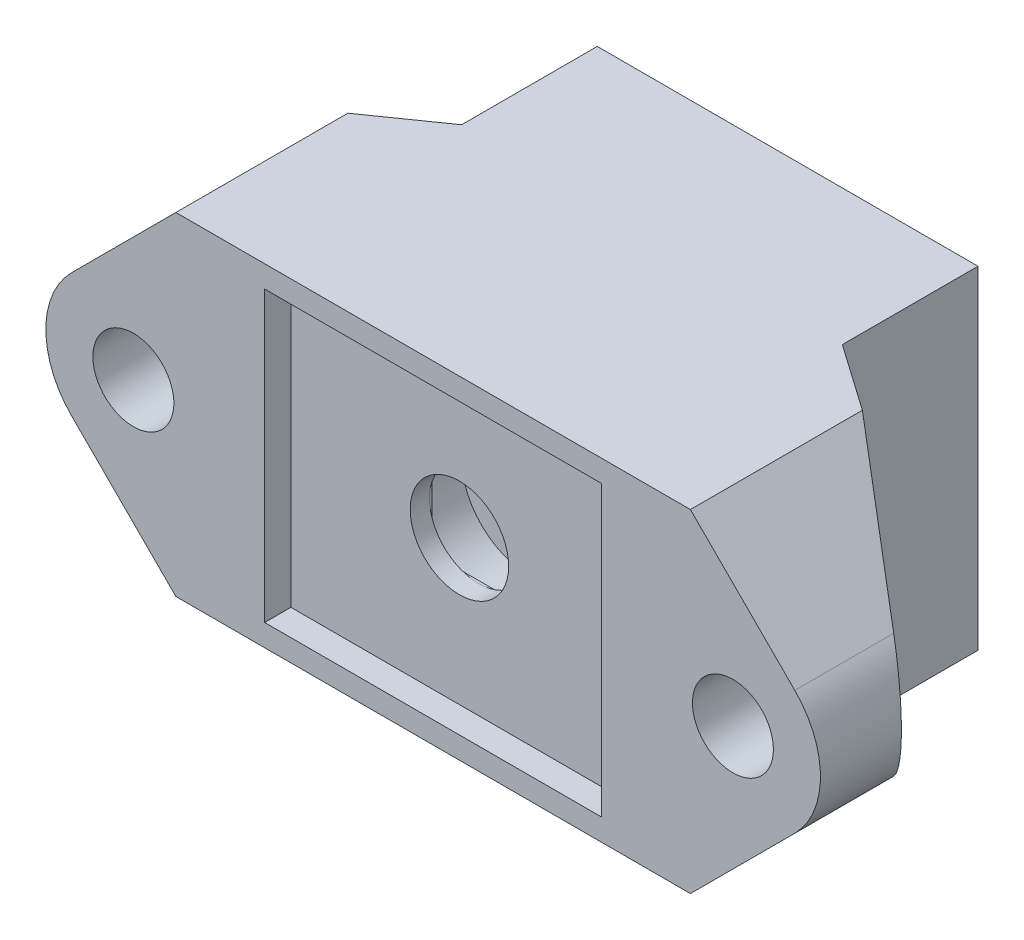
ISO-10303-21;
HEADER;
FILE_DESCRIPTION(('STEP AP214'),'2;1');
FILE_NAME('part.step','',(''),(''),'','','');
FILE_SCHEMA(('AUTOMOTIVE_DESIGN { 1 0 10303 214 1 1 1 1 }'));
ENDSEC;
DATA;
#1=APPLICATION_CONTEXT('core data for automotive mechanical design processes');
#2=APPLICATION_PROTOCOL_DEFINITION('international standard','automotive_design',2000,#1);
#3=PRODUCT_CONTEXT('',#1,'mechanical');
#4=PRODUCT('Part','Part','',(#3));
#5=PRODUCT_RELATED_PRODUCT_CATEGORY('part','',(#4));
#6=PRODUCT_DEFINITION_FORMATION('','',#4);
#7=PRODUCT_DEFINITION_CONTEXT('part definition',#1,'design');
#8=PRODUCT_DEFINITION('design','',#6,#7);
#9=PRODUCT_DEFINITION_SHAPE('','',#8);
#10=(LENGTH_UNIT() NAMED_UNIT(*) SI_UNIT(.MILLI.,.METRE.));
#11=(NAMED_UNIT(*) PLANE_ANGLE_UNIT() SI_UNIT($,.RADIAN.));
#12=(NAMED_UNIT(*) SI_UNIT($,.STERADIAN.) SOLID_ANGLE_UNIT());
#13=UNCERTAINTY_MEASURE_WITH_UNIT(LENGTH_MEASURE(1.E-05),#10,'distance_accuracy_value','');
#14=(GEOMETRIC_REPRESENTATION_CONTEXT(3) GLOBAL_UNCERTAINTY_ASSIGNED_CONTEXT((#13)) GLOBAL_UNIT_ASSIGNED_CONTEXT((#10,
#11,#12)) REPRESENTATION_CONTEXT('',''));
#15=CARTESIAN_POINT('',(0.,0.,0.));
#16=DIRECTION('',(0.,0.,1.));
#17=DIRECTION('',(1.,0.,0.));
#18=AXIS2_PLACEMENT_3D('',#15,#16,#17);
#19=CARTESIAN_POINT('',(0.,0.,0.));
#20=DIRECTION('',(0.,0.,-1.));
#21=DIRECTION('',(-1.,0.,0.));
#22=AXIS2_PLACEMENT_3D('',#19,#20,#21);
#23=PLANE('',#22);
#24=CARTESIAN_POINT('',(0.,0.,0.));
#25=DIRECTION('',(0.,0.,-1.));
#26=DIRECTION('',(-1.,0.,0.));
#27=AXIS2_PLACEMENT_3D('',#24,#25,#26);
#28=CIRCLE('',#27,1.80512886940355);
#29=CARTESIAN_POINT('',(-1.80512886940355,0.,0.));
#30=VERTEX_POINT('',#29);
#31=EDGE_CURVE('E50',#30,#30,#28,.T.);
#32=ORIENTED_EDGE('',*,*,#31,.T.);
#33=EDGE_LOOP('',(#32));
#34=FACE_BOUND('',#33,.T.);
#35=CARTESIAN_POINT('',(0.,0.,0.));
#36=DIRECTION('',(0.,0.,1.));
#37=DIRECTION('',(1.,0.,0.));
#38=AXIS2_PLACEMENT_3D('',#35,#36,#37);
#39=CIRCLE('',#38,1.65);
#40=CARTESIAN_POINT('',(1.65,0.,0.));
#41=VERTEX_POINT('',#40);
#42=EDGE_CURVE('E242',#41,#41,#39,.T.);
#43=ORIENTED_EDGE('',*,*,#42,.T.);
#44=EDGE_LOOP('',(#43));
#45=FACE_BOUND('',#44,.T.);
#46=ADVANCED_FACE('F41',(#34,#45),#23,.T.);
#47=CARTESIAN_POINT('',(0.,0.,4.));
#48=DIRECTION('',(0.,0.,1.));
#49=DIRECTION('',(1.,0.,0.));
#50=AXIS2_PLACEMENT_3D('',#47,#48,#49);
#51=PLANE('',#50);
#52=CARTESIAN_POINT('',(0.,0.,4.));
#53=DIRECTION('',(0.,0.,1.));
#54=DIRECTION('',(1.,0.,0.));
#55=AXIS2_PLACEMENT_3D('',#52,#53,#54);
#56=CIRCLE('',#55,3.1);
#57=CARTESIAN_POINT('',(-2.25,2.13248681121361,4.));
#58=VERTEX_POINT('',#57);
#59=CARTESIAN_POINT('',(-2.25,-2.13248681121361,4.));
#60=VERTEX_POINT('',#59);
#61=EDGE_CURVE('E494',#58,#60,#56,.T.);
#62=ORIENTED_EDGE('',*,*,#61,.F.);
#63=DIRECTION('',(0.,1.,0.));
#64=VECTOR('',#63,1.);
#65=CARTESIAN_POINT('',(-2.25,-2.25,4.));
#66=LINE('',#65,#64);
#67=EDGE_CURVE('E377',#60,#58,#66,.T.);
#68=ORIENTED_EDGE('',*,*,#67,.F.);
#69=EDGE_LOOP('',(#62,#68));
#70=FACE_BOUND('',#69,.T.);
#71=ADVANCED_FACE('F286',(#70),#51,.F.);
#72=CARTESIAN_POINT('',(-2.13248681121361,-2.25,4.));
#73=VERTEX_POINT('',#72);
#74=CARTESIAN_POINT('',(2.13248681121361,-2.25,4.));
#75=VERTEX_POINT('',#74);
#76=EDGE_CURVE('E496',#73,#75,#56,.T.);
#77=ORIENTED_EDGE('',*,*,#76,.F.);
#78=DIRECTION('',(-1.,0.,0.));
#79=VECTOR('',#78,1.);
#80=CARTESIAN_POINT('',(2.25,-2.25,4.));
#81=LINE('',#80,#79);
#82=EDGE_CURVE('E390',#75,#73,#81,.T.);
#83=ORIENTED_EDGE('',*,*,#82,.F.);
#84=EDGE_LOOP('',(#77,#83));
#85=FACE_BOUND('',#84,.T.);
#86=ADVANCED_FACE('F291',(#85),#51,.F.);
#87=CARTESIAN_POINT('',(2.25,-2.13248681121361,4.));
#88=VERTEX_POINT('',#87);
#89=CARTESIAN_POINT('',(2.25,2.13248681121361,4.));
#90=VERTEX_POINT('',#89);
#91=EDGE_CURVE('E409',#88,#90,#56,.T.);
#92=ORIENTED_EDGE('',*,*,#91,.F.);
#93=DIRECTION('',(0.,-1.,0.));
#94=VECTOR('',#93,1.);
#95=CARTESIAN_POINT('',(2.25,-2.25,4.));
#96=LINE('',#95,#94);
#97=EDGE_CURVE('E386',#90,#88,#96,.T.);
#98=ORIENTED_EDGE('',*,*,#97,.F.);
#99=EDGE_LOOP('',(#92,#98));
#100=FACE_BOUND('',#99,.T.);
#101=ADVANCED_FACE('F456',(#100),#51,.F.);
#102=CARTESIAN_POINT('',(0.,0.,5.));
#103=DIRECTION('',(0.,0.,-1.));
#104=DIRECTION('',(-1.,0.,0.));
#105=AXIS2_PLACEMENT_3D('',#102,#103,#104);
#106=CYLINDRICAL_SURFACE('',#105,1.65);
#107=ORIENTED_EDGE('',*,*,#42,.F.);
#108=EDGE_LOOP('',(#107));
#109=FACE_BOUND('',#108,.T.);
#110=CARTESIAN_POINT('',(0.,0.,1.8));
#111=DIRECTION('',(0.,0.,1.));
#112=DIRECTION('',(1.,0.,0.));
#113=AXIS2_PLACEMENT_3D('',#110,#111,#112);
#114=CIRCLE('',#113,1.65);
#115=CARTESIAN_POINT('',(1.65,0.,1.8));
#116=VERTEX_POINT('',#115);
#117=EDGE_CURVE('E248',#116,#116,#114,.T.);
#118=ORIENTED_EDGE('',*,*,#117,.T.);
#119=EDGE_LOOP('',(#118));
#120=FACE_BOUND('',#119,.T.);
#121=ADVANCED_FACE('F453',(#109,#120),#106,.F.);
#122=CARTESIAN_POINT('',(0.,0.,5.));
#123=DIRECTION('',(0.,0.,-1.));
#124=DIRECTION('',(-1.,0.,0.));
#125=AXIS2_PLACEMENT_3D('',#122,#123,#124);
#126=PLANE('',#125);
#127=CARTESIAN_POINT('',(0.,0.,5.));
#128=DIRECTION('',(0.,0.,1.));
#129=DIRECTION('',(1.,0.,0.));
#130=AXIS2_PLACEMENT_3D('',#127,#128,#129);
#131=CIRCLE('',#130,2.25);
#132=CARTESIAN_POINT('',(2.25,0.,5.));
#133=VERTEX_POINT('',#132);
#134=EDGE_CURVE('E405',#133,#133,#131,.T.);
#135=ORIENTED_EDGE('',*,*,#134,.F.);
#136=EDGE_LOOP('',(#135));
#137=FACE_BOUND('',#136,.T.);
#138=DIRECTION('',(0.,-1.,0.));
#139=VECTOR('',#138,1.);
#140=CARTESIAN_POINT('',(-7.7,6.6,5.));
#141=LINE('',#140,#139);
#142=CARTESIAN_POINT('',(-7.7,6.6,5.));
#143=VERTEX_POINT('',#142);
#144=CARTESIAN_POINT('',(-7.7,-6.6,5.));
#145=VERTEX_POINT('',#144);
#146=EDGE_CURVE('E419',#143,#145,#141,.T.);
#147=ORIENTED_EDGE('',*,*,#146,.T.);
#148=DIRECTION('',(1.,0.,0.));
#149=VECTOR('',#148,1.);
#150=CARTESIAN_POINT('',(-7.7,-6.6,5.));
#151=LINE('',#150,#149);
#152=CARTESIAN_POINT('',(7.7,-6.6,5.));
#153=VERTEX_POINT('',#152);
#154=EDGE_CURVE('E251',#145,#153,#151,.T.);
#155=ORIENTED_EDGE('',*,*,#154,.T.);
#156=DIRECTION('',(0.,1.,0.));
#157=VECTOR('',#156,1.);
#158=CARTESIAN_POINT('',(7.7,-6.6,5.));
#159=LINE('',#158,#157);
#160=CARTESIAN_POINT('',(7.7,6.6,5.));
#161=VERTEX_POINT('',#160);
#162=EDGE_CURVE('E429',#153,#161,#159,.T.);
#163=ORIENTED_EDGE('',*,*,#162,.T.);
#164=DIRECTION('',(-1.,0.,0.));
#165=VECTOR('',#164,1.);
#166=CARTESIAN_POINT('',(7.7,6.6,5.));
#167=LINE('',#166,#165);
#168=EDGE_CURVE('E432',#161,#143,#167,.T.);
#169=ORIENTED_EDGE('',*,*,#168,.T.);
#170=EDGE_LOOP('',(#147,#155,#163,#169));
#171=FACE_BOUND('',#170,.T.);
#172=ADVANCED_FACE('F297',(#137,#171),#126,.F.);
#173=CARTESIAN_POINT('',(8.7,-7.6,5.));
#174=DIRECTION('',(-1.,0.,0.));
#175=DIRECTION('',(0.,0.,1.));
#176=AXIS2_PLACEMENT_3D('',#173,#174,#175);
#177=PLANE('',#176);
#178=DIRECTION('',(0.,0.,-1.));
#179=VECTOR('',#178,1.);
#180=CARTESIAN_POINT('',(8.7,7.6,5.));
#181=LINE('',#180,#179);
#182=CARTESIAN_POINT('',(8.7,7.6,-3.8));
#183=VERTEX_POINT('',#182);
#184=CARTESIAN_POINT('',(8.7,7.6,-10.));
#185=VERTEX_POINT('',#184);
#186=EDGE_CURVE('E240',#183,#185,#181,.T.);
#187=ORIENTED_EDGE('',*,*,#186,.F.);
#188=DIRECTION('',(0.,-1.,0.));
#189=VECTOR('',#188,1.);
#190=CARTESIAN_POINT('',(8.7,7.6,-3.8));
#191=LINE('',#190,#189);
#192=CARTESIAN_POINT('',(8.7,-7.6,-3.8));
#193=VERTEX_POINT('',#192);
#194=EDGE_CURVE('E605',#183,#193,#191,.T.);
#195=ORIENTED_EDGE('',*,*,#194,.T.);
#196=DIRECTION('',(0.,0.,-1.));
#197=VECTOR('',#196,1.);
#198=CARTESIAN_POINT('',(8.7,-7.6,5.));
#199=LINE('',#198,#197);
#200=CARTESIAN_POINT('',(8.7,-7.6,-10.));
#201=VERTEX_POINT('',#200);
#202=EDGE_CURVE('E238',#193,#201,#199,.T.);
#203=ORIENTED_EDGE('',*,*,#202,.T.);
#204=DIRECTION('',(0.,-1.,0.));
#205=VECTOR('',#204,1.);
#206=CARTESIAN_POINT('',(8.7,-7.6,-10.));
#207=LINE('',#206,#205);
#208=EDGE_CURVE('E341',#185,#201,#207,.T.);
#209=ORIENTED_EDGE('',*,*,#208,.F.);
#210=EDGE_LOOP('',(#187,#195,#203,#209));
#211=FACE_BOUND('',#210,.T.);
#212=ADVANCED_FACE('F307',(#211),#177,.F.);
#213=CARTESIAN_POINT('',(-8.7,7.6,5.));
#214=DIRECTION('',(0.,-1.,0.));
#215=DIRECTION('',(0.,0.,-1.));
#216=AXIS2_PLACEMENT_3D('',#213,#214,#215);
#217=PLANE('',#216);
#218=DIRECTION('',(0.,0.,-1.));
#219=VECTOR('',#218,1.);
#220=CARTESIAN_POINT('',(-8.7,7.6,5.));
#221=LINE('',#220,#219);
#222=CARTESIAN_POINT('',(-8.7,7.6,-3.8));
#223=VERTEX_POINT('',#222);
#224=CARTESIAN_POINT('',(-8.7,7.6,-10.));
#225=VERTEX_POINT('',#224);
#226=EDGE_CURVE('E237',#223,#225,#221,.T.);
#227=ORIENTED_EDGE('',*,*,#226,.F.);
#228=DIRECTION('',(-0.819152044288995,0.,0.573576436351041));
#229=VECTOR('',#228,1.);
#230=CARTESIAN_POINT('',(-8.7,7.6,-3.8));
#231=LINE('',#230,#229);
#232=CARTESIAN_POINT('',(-11.7568542494924,7.6,-1.65956761129704));
#233=VERTEX_POINT('',#232);
#234=EDGE_CURVE('E65',#223,#233,#231,.T.);
#235=ORIENTED_EDGE('',*,*,#234,.T.);
#236=DIRECTION('',(0.,0.,1.));
#237=VECTOR('',#236,1.);
#238=CARTESIAN_POINT('',(-11.7568542494924,7.6,-3.8));
#239=LINE('',#238,#237);
#240=CARTESIAN_POINT('',(-11.7568542494924,7.6,6.2));
#241=VERTEX_POINT('',#240);
#242=EDGE_CURVE('E221',#233,#241,#239,.T.);
#243=ORIENTED_EDGE('',*,*,#242,.T.);
#244=DIRECTION('',(-1.,0.,0.));
#245=VECTOR('',#244,1.);
#246=CARTESIAN_POINT('',(-8.7,7.6,6.2));
#247=LINE('',#246,#245);
#248=CARTESIAN_POINT('',(11.7568542494924,7.6,6.2));
#249=VERTEX_POINT('',#248);
#250=EDGE_CURVE('E448',#249,#241,#247,.T.);
#251=ORIENTED_EDGE('',*,*,#250,.F.);
#252=DIRECTION('',(0.,0.,1.));
#253=VECTOR('',#252,1.);
#254=CARTESIAN_POINT('',(11.7568542494924,7.6,-3.8));
#255=LINE('',#254,#253);
#256=CARTESIAN_POINT('',(11.7568542494924,7.6,-1.65956761129704));
#257=VERTEX_POINT('',#256);
#258=EDGE_CURVE('E608',#257,#249,#255,.T.);
#259=ORIENTED_EDGE('',*,*,#258,.F.);
#260=DIRECTION('',(-0.819152044288995,0.,-0.573576436351041));
#261=VECTOR('',#260,1.);
#262=CARTESIAN_POINT('',(8.7,7.6,-3.8));
#263=LINE('',#262,#261);
#264=EDGE_CURVE('E659',#257,#183,#263,.T.);
#265=ORIENTED_EDGE('',*,*,#264,.T.);
#266=ORIENTED_EDGE('',*,*,#186,.T.);
#267=DIRECTION('',(1.,0.,0.));
#268=VECTOR('',#267,1.);
#269=CARTESIAN_POINT('',(-8.7,7.6,-10.));
#270=LINE('',#269,#268);
#271=EDGE_CURVE('E344',#225,#185,#270,.T.);
#272=ORIENTED_EDGE('',*,*,#271,.F.);
#273=EDGE_LOOP('',(#227,#235,#243,#251,#259,#265,#266,#272));
#274=FACE_BOUND('',#273,.T.);
#275=ADVANCED_FACE('F304',(#274),#217,.F.);
#276=CARTESIAN_POINT('',(-8.7,-7.6,5.));
#277=DIRECTION('',(1.,0.,0.));
#278=DIRECTION('',(0.,0.,-1.));
#279=AXIS2_PLACEMENT_3D('',#276,#277,#278);
#280=PLANE('',#279);
#281=DIRECTION('',(0.,0.,-1.));
#282=VECTOR('',#281,1.);
#283=CARTESIAN_POINT('',(-8.7,-7.6,5.));
#284=LINE('',#283,#282);
#285=CARTESIAN_POINT('',(-8.7,-7.6,-3.8));
#286=VERTEX_POINT('',#285);
#287=CARTESIAN_POINT('',(-8.7,-7.6,-10.));
#288=VERTEX_POINT('',#287);
#289=EDGE_CURVE('E228',#286,#288,#284,.T.);
#290=ORIENTED_EDGE('',*,*,#289,.F.);
#291=DIRECTION('',(0.,1.,0.));
#292=VECTOR('',#291,1.);
#293=CARTESIAN_POINT('',(-8.7,7.6,-3.8));
#294=LINE('',#293,#292);
#295=EDGE_CURVE('E212',#286,#223,#294,.T.);
#296=ORIENTED_EDGE('',*,*,#295,.T.);
#297=ORIENTED_EDGE('',*,*,#226,.T.);
#298=DIRECTION('',(0.,1.,0.));
#299=VECTOR('',#298,1.);
#300=CARTESIAN_POINT('',(-8.7,-7.6,-10.));
#301=LINE('',#300,#299);
#302=EDGE_CURVE('E236',#288,#225,#301,.T.);
#303=ORIENTED_EDGE('',*,*,#302,.F.);
#304=EDGE_LOOP('',(#290,#296,#297,#303));
#305=FACE_BOUND('',#304,.T.);
#306=ADVANCED_FACE('F234',(#305),#280,.F.);
#307=CARTESIAN_POINT('',(-8.7,-7.6,5.));
#308=DIRECTION('',(0.,1.,0.));
#309=DIRECTION('',(-1.,0.,0.));
#310=AXIS2_PLACEMENT_3D('',#307,#308,#309);
#311=PLANE('',#310);
#312=DIRECTION('',(0.,0.,1.));
#313=VECTOR('',#312,1.);
#314=CARTESIAN_POINT('',(-11.7568542494924,-7.6,-3.8));
#315=LINE('',#314,#313);
#316=CARTESIAN_POINT('',(-11.7568542494924,-7.6,-1.65956761129704));
#317=VERTEX_POINT('',#316);
#318=CARTESIAN_POINT('',(-11.7568542494924,-7.6,6.2));
#319=VERTEX_POINT('',#318);
#320=EDGE_CURVE('E231',#317,#319,#315,.T.);
#321=ORIENTED_EDGE('',*,*,#320,.F.);
#322=DIRECTION('',(-0.819152044288995,0.,0.573576436351041));
#323=VECTOR('',#322,1.);
#324=CARTESIAN_POINT('',(-8.7,-7.6,-3.8));
#325=LINE('',#324,#323);
#326=EDGE_CURVE('E216',#286,#317,#325,.T.);
#327=ORIENTED_EDGE('',*,*,#326,.F.);
#328=ORIENTED_EDGE('',*,*,#289,.T.);
#329=DIRECTION('',(-1.,0.,0.));
#330=VECTOR('',#329,1.);
#331=CARTESIAN_POINT('',(-8.7,-7.6,-10.));
#332=LINE('',#331,#330);
#333=EDGE_CURVE('E342',#201,#288,#332,.T.);
#334=ORIENTED_EDGE('',*,*,#333,.F.);
#335=ORIENTED_EDGE('',*,*,#202,.F.);
#336=DIRECTION('',(-0.819152044288995,0.,-0.573576436351041));
#337=VECTOR('',#336,1.);
#338=CARTESIAN_POINT('',(8.7,-7.6,-3.8));
#339=LINE('',#338,#337);
#340=CARTESIAN_POINT('',(11.7568542494924,-7.6,-1.65956761129704));
#341=VERTEX_POINT('',#340);
#342=EDGE_CURVE('E57',#341,#193,#339,.T.);
#343=ORIENTED_EDGE('',*,*,#342,.F.);
#344=DIRECTION('',(0.,0.,1.));
#345=VECTOR('',#344,1.);
#346=CARTESIAN_POINT('',(11.7568542494924,-7.6,-3.8));
#347=LINE('',#346,#345);
#348=CARTESIAN_POINT('',(11.7568542494924,-7.6,6.2));
#349=VERTEX_POINT('',#348);
#350=EDGE_CURVE('E614',#341,#349,#347,.T.);
#351=ORIENTED_EDGE('',*,*,#350,.T.);
#352=DIRECTION('',(1.,0.,0.));
#353=VECTOR('',#352,1.);
#354=CARTESIAN_POINT('',(-8.7,-7.6,6.2));
#355=LINE('',#354,#353);
#356=EDGE_CURVE('E445',#319,#349,#355,.T.);
#357=ORIENTED_EDGE('',*,*,#356,.F.);
#358=EDGE_LOOP('',(#321,#327,#328,#334,#335,#343,#351,#357));
#359=FACE_BOUND('',#358,.T.);
#360=ADVANCED_FACE('F226',(#359),#311,.F.);
#361=CARTESIAN_POINT('',(0.,0.,6.2));
#362=DIRECTION('',(0.,0.,1.));
#363=DIRECTION('',(1.,0.,0.));
#364=AXIS2_PLACEMENT_3D('',#361,#362,#363);
#365=PLANE('',#364);
#366=ORIENTED_EDGE('',*,*,#250,.T.);
#367=DIRECTION('',(-0.707106781186544,-0.707106781186551,0.));
#368=VECTOR('',#367,1.);
#369=CARTESIAN_POINT('',(-16.5284271247462,2.82842712474618,6.2));
#370=LINE('',#369,#368);
#371=CARTESIAN_POINT('',(-16.5284271247462,2.82842712474618,6.2));
#372=VERTEX_POINT('',#371);
#373=EDGE_CURVE('E595',#241,#372,#370,.T.);
#374=ORIENTED_EDGE('',*,*,#373,.T.);
#375=CARTESIAN_POINT('',(-13.7,0.,6.2));
#376=DIRECTION('',(0.,0.,1.));
#377=DIRECTION('',(-1.,0.,0.));
#378=AXIS2_PLACEMENT_3D('',#375,#376,#377);
#379=CIRCLE('',#378,4.);
#380=CARTESIAN_POINT('',(-16.5284271247462,-2.82842712474618,6.2));
#381=VERTEX_POINT('',#380);
#382=EDGE_CURVE('E633',#372,#381,#379,.T.);
#383=ORIENTED_EDGE('',*,*,#382,.T.);
#384=DIRECTION('',(0.707106781186544,-0.707106781186551,0.));
#385=VECTOR('',#384,1.);
#386=CARTESIAN_POINT('',(-11.7568542494924,-7.6,6.2));
#387=LINE('',#386,#385);
#388=EDGE_CURVE('E222',#381,#319,#387,.T.);
#389=ORIENTED_EDGE('',*,*,#388,.T.);
#390=ORIENTED_EDGE('',*,*,#356,.T.);
#391=DIRECTION('',(0.707106781186544,0.707106781186551,0.));
#392=VECTOR('',#391,1.);
#393=CARTESIAN_POINT('',(11.7568542494924,-7.6,6.2));
#394=LINE('',#393,#392);
#395=CARTESIAN_POINT('',(16.5284271247462,-2.82842712474618,6.2));
#396=VERTEX_POINT('',#395);
#397=EDGE_CURVE('E602',#349,#396,#394,.T.);
#398=ORIENTED_EDGE('',*,*,#397,.T.);
#399=CARTESIAN_POINT('',(13.7,0.,6.2));
#400=DIRECTION('',(0.,0.,1.));
#401=DIRECTION('',(1.,0.,0.));
#402=AXIS2_PLACEMENT_3D('',#399,#400,#401);
#403=CIRCLE('',#402,4.);
#404=CARTESIAN_POINT('',(16.5284271247462,2.82842712474618,6.2));
#405=VERTEX_POINT('',#404);
#406=EDGE_CURVE('E594',#396,#405,#403,.T.);
#407=ORIENTED_EDGE('',*,*,#406,.T.);
#408=DIRECTION('',(-0.707106781186544,0.707106781186551,0.));
#409=VECTOR('',#408,1.);
#410=CARTESIAN_POINT('',(16.5284271247462,2.82842712474618,6.2));
#411=LINE('',#410,#409);
#412=EDGE_CURVE('E598',#405,#249,#411,.T.);
#413=ORIENTED_EDGE('',*,*,#412,.T.);
#414=EDGE_LOOP('',(#366,#374,#383,#389,#390,#398,#407,#413));
#415=FACE_BOUND('',#414,.T.);
#416=DIRECTION('',(0.,1.,0.));
#417=VECTOR('',#416,1.);
#418=CARTESIAN_POINT('',(7.7,-6.6,6.2));
#419=LINE('',#418,#417);
#420=CARTESIAN_POINT('',(7.7,-6.6,6.2));
#421=VERTEX_POINT('',#420);
#422=CARTESIAN_POINT('',(7.7,6.6,6.2));
#423=VERTEX_POINT('',#422);
#424=EDGE_CURVE('E418',#421,#423,#419,.T.);
#425=ORIENTED_EDGE('',*,*,#424,.F.);
#426=DIRECTION('',(1.,0.,0.));
#427=VECTOR('',#426,1.);
#428=CARTESIAN_POINT('',(-7.7,-6.6,6.2));
#429=LINE('',#428,#427);
#430=CARTESIAN_POINT('',(-7.7,-6.6,6.2));
#431=VERTEX_POINT('',#430);
#432=EDGE_CURVE('E416',#431,#421,#429,.T.);
#433=ORIENTED_EDGE('',*,*,#432,.F.);
#434=DIRECTION('',(0.,-1.,0.));
#435=VECTOR('',#434,1.);
#436=CARTESIAN_POINT('',(-7.7,6.6,6.2));
#437=LINE('',#436,#435);
#438=CARTESIAN_POINT('',(-7.7,6.6,6.2));
#439=VERTEX_POINT('',#438);
#440=EDGE_CURVE('E424',#439,#431,#437,.T.);
#441=ORIENTED_EDGE('',*,*,#440,.F.);
#442=DIRECTION('',(-1.,0.,0.));
#443=VECTOR('',#442,1.);
#444=CARTESIAN_POINT('',(7.7,6.6,6.2));
#445=LINE('',#444,#443);
#446=EDGE_CURVE('E421',#423,#439,#445,.T.);
#447=ORIENTED_EDGE('',*,*,#446,.F.);
#448=EDGE_LOOP('',(#425,#433,#441,#447));
#449=FACE_BOUND('',#448,.T.);
#450=CARTESIAN_POINT('',(-13.7,0.,6.2));
#451=DIRECTION('',(0.,0.,1.));
#452=DIRECTION('',(-1.,0.,0.));
#453=AXIS2_PLACEMENT_3D('',#450,#451,#452);
#454=CIRCLE('',#453,1.85);
#455=CARTESIAN_POINT('',(-15.55,0.,6.2));
#456=VERTEX_POINT('',#455);
#457=EDGE_CURVE('E590',#456,#456,#454,.T.);
#458=ORIENTED_EDGE('',*,*,#457,.F.);
#459=EDGE_LOOP('',(#458));
#460=FACE_BOUND('',#459,.T.);
#461=CARTESIAN_POINT('',(13.7,0.,6.2));
#462=DIRECTION('',(0.,0.,1.));
#463=DIRECTION('',(1.,0.,0.));
#464=AXIS2_PLACEMENT_3D('',#461,#462,#463);
#465=CIRCLE('',#464,1.85);
#466=CARTESIAN_POINT('',(15.55,0.,6.2));
#467=VERTEX_POINT('',#466);
#468=EDGE_CURVE('E351',#467,#467,#465,.T.);
#469=ORIENTED_EDGE('',*,*,#468,.F.);
#470=EDGE_LOOP('',(#469));
#471=FACE_BOUND('',#470,.T.);
#472=ADVANCED_FACE('F301',(#415,#449,#460,#471),#365,.T.);
#473=CARTESIAN_POINT('',(-7.7,-6.6,6.2));
#474=DIRECTION('',(0.,1.,0.));
#475=DIRECTION('',(-1.,0.,0.));
#476=AXIS2_PLACEMENT_3D('',#473,#474,#475);
#477=PLANE('',#476);
#478=ORIENTED_EDGE('',*,*,#154,.F.);
#479=DIRECTION('',(0.,0.,-1.));
#480=VECTOR('',#479,1.);
#481=CARTESIAN_POINT('',(-7.7,-6.6,6.2));
#482=LINE('',#481,#480);
#483=EDGE_CURVE('E426',#431,#145,#482,.T.);
#484=ORIENTED_EDGE('',*,*,#483,.F.);
#485=ORIENTED_EDGE('',*,*,#432,.T.);
#486=DIRECTION('',(0.,0.,-1.));
#487=VECTOR('',#486,1.);
#488=CARTESIAN_POINT('',(7.7,-6.6,6.2));
#489=LINE('',#488,#487);
#490=EDGE_CURVE('E442',#421,#153,#489,.T.);
#491=ORIENTED_EDGE('',*,*,#490,.T.);
#492=EDGE_LOOP('',(#478,#484,#485,#491));
#493=FACE_BOUND('',#492,.T.);
#494=ADVANCED_FACE('F570',(#493),#477,.T.);
#495=CARTESIAN_POINT('',(7.7,-6.6,6.2));
#496=DIRECTION('',(-1.,0.,0.));
#497=DIRECTION('',(0.,0.,1.));
#498=AXIS2_PLACEMENT_3D('',#495,#496,#497);
#499=PLANE('',#498);
#500=ORIENTED_EDGE('',*,*,#162,.F.);
#501=ORIENTED_EDGE('',*,*,#490,.F.);
#502=ORIENTED_EDGE('',*,*,#424,.T.);
#503=DIRECTION('',(0.,0.,-1.));
#504=VECTOR('',#503,1.);
#505=CARTESIAN_POINT('',(7.7,6.6,6.2));
#506=LINE('',#505,#504);
#507=EDGE_CURVE('E440',#423,#161,#506,.T.);
#508=ORIENTED_EDGE('',*,*,#507,.T.);
#509=EDGE_LOOP('',(#500,#501,#502,#508));
#510=FACE_BOUND('',#509,.T.);
#511=ADVANCED_FACE('F566',(#510),#499,.T.);
#512=CARTESIAN_POINT('',(7.7,6.6,6.2));
#513=DIRECTION('',(0.,-1.,0.));
#514=DIRECTION('',(0.,0.,-1.));
#515=AXIS2_PLACEMENT_3D('',#512,#513,#514);
#516=PLANE('',#515);
#517=ORIENTED_EDGE('',*,*,#168,.F.);
#518=ORIENTED_EDGE('',*,*,#507,.F.);
#519=ORIENTED_EDGE('',*,*,#446,.T.);
#520=DIRECTION('',(0.,0.,-1.));
#521=VECTOR('',#520,1.);
#522=CARTESIAN_POINT('',(-7.7,6.6,6.2));
#523=LINE('',#522,#521);
#524=EDGE_CURVE('E438',#439,#143,#523,.T.);
#525=ORIENTED_EDGE('',*,*,#524,.T.);
#526=EDGE_LOOP('',(#517,#518,#519,#525));
#527=FACE_BOUND('',#526,.T.);
#528=ADVANCED_FACE('F562',(#527),#516,.T.);
#529=CARTESIAN_POINT('',(-7.7,6.6,6.2));
#530=DIRECTION('',(1.,0.,0.));
#531=DIRECTION('',(0.,0.,-1.));
#532=AXIS2_PLACEMENT_3D('',#529,#530,#531);
#533=PLANE('',#532);
#534=ORIENTED_EDGE('',*,*,#146,.F.);
#535=ORIENTED_EDGE('',*,*,#524,.F.);
#536=ORIENTED_EDGE('',*,*,#440,.T.);
#537=ORIENTED_EDGE('',*,*,#483,.T.);
#538=EDGE_LOOP('',(#534,#535,#536,#537));
#539=FACE_BOUND('',#538,.T.);
#540=ADVANCED_FACE('F468',(#539),#533,.T.);
#541=CARTESIAN_POINT('',(0.,0.,1.8));
#542=DIRECTION('',(0.,0.,1.));
#543=DIRECTION('',(1.,0.,0.));
#544=AXIS2_PLACEMENT_3D('',#541,#542,#543);
#545=CYLINDRICAL_SURFACE('',#544,3.1);
#546=CARTESIAN_POINT('',(0.,0.,1.8));
#547=DIRECTION('',(0.,0.,1.));
#548=DIRECTION('',(1.,0.,0.));
#549=AXIS2_PLACEMENT_3D('',#546,#547,#548);
#550=CIRCLE('',#549,3.1);
#551=CARTESIAN_POINT('',(3.1,0.,1.8));
#552=VERTEX_POINT('',#551);
#553=EDGE_CURVE('E252',#552,#552,#550,.T.);
#554=ORIENTED_EDGE('',*,*,#553,.F.);
#555=EDGE_LOOP('',(#554));
#556=FACE_BOUND('',#555,.T.);
#557=CARTESIAN_POINT('',(2.13248681121361,2.25,4.));
#558=VERTEX_POINT('',#557);
#559=EDGE_CURVE('E412',#90,#558,#56,.T.);
#560=ORIENTED_EDGE('',*,*,#559,.T.);
#561=CARTESIAN_POINT('',(-2.13248681121361,2.25,4.));
#562=VERTEX_POINT('',#561);
#563=EDGE_CURVE('E415',#558,#562,#56,.T.);
#564=ORIENTED_EDGE('',*,*,#563,.T.);
#565=CARTESIAN_POINT('',(0.,0.,4.));
#566=DIRECTION('',(0.,0.,1.));
#567=DIRECTION('',(1.,0.,0.));
#568=AXIS2_PLACEMENT_3D('',#565,#566,#567);
#569=CIRCLE('',#568,3.1);
#570=EDGE_CURVE('E394',#58,#562,#569,.F.);
#571=ORIENTED_EDGE('',*,*,#570,.F.);
#572=ORIENTED_EDGE('',*,*,#61,.T.);
#573=EDGE_CURVE('E406',#73,#60,#569,.F.);
#574=ORIENTED_EDGE('',*,*,#573,.F.);
#575=ORIENTED_EDGE('',*,*,#76,.T.);
#576=EDGE_CURVE('E403',#88,#75,#569,.F.);
#577=ORIENTED_EDGE('',*,*,#576,.F.);
#578=ORIENTED_EDGE('',*,*,#91,.T.);
#579=EDGE_LOOP('',(#560,#564,#571,#572,#574,#575,#577,#578));
#580=FACE_BOUND('',#579,.T.);
#581=ADVANCED_FACE('F462',(#556,#580),#545,.F.);
#582=CARTESIAN_POINT('',(0.,0.,1.8));
#583=DIRECTION('',(0.,0.,1.));
#584=DIRECTION('',(1.,0.,0.));
#585=AXIS2_PLACEMENT_3D('',#582,#583,#584);
#586=PLANE('',#585);
#587=ORIENTED_EDGE('',*,*,#117,.F.);
#588=EDGE_LOOP('',(#587));
#589=FACE_BOUND('',#588,.T.);
#590=ORIENTED_EDGE('',*,*,#553,.T.);
#591=EDGE_LOOP('',(#590));
#592=FACE_BOUND('',#591,.T.);
#593=ADVANCED_FACE('F459',(#589,#592),#586,.T.);
#594=ORIENTED_EDGE('',*,*,#563,.F.);
#595=DIRECTION('',(1.,0.,0.));
#596=VECTOR('',#595,1.);
#597=CARTESIAN_POINT('',(2.25,2.25,4.));
#598=LINE('',#597,#596);
#599=EDGE_CURVE('E381',#562,#558,#598,.T.);
#600=ORIENTED_EDGE('',*,*,#599,.F.);
#601=EDGE_LOOP('',(#594,#600));
#602=FACE_BOUND('',#601,.T.);
#603=ADVANCED_FACE('F294',(#602),#51,.F.);
#604=CARTESIAN_POINT('',(0.,0.,-2.36396103067893));
#605=DIRECTION('',(0.,0.,1.));
#606=DIRECTION('',(1.,0.,0.));
#607=AXIS2_PLACEMENT_3D('',#604,#605,#606);
#608=CYLINDRICAL_SURFACE('',#607,2.25);
#609=CARTESIAN_POINT('',(0.,0.,4.12));
#610=DIRECTION('',(0.,0.,1.));
#611=DIRECTION('',(1.,0.,0.));
#612=AXIS2_PLACEMENT_3D('',#609,#610,#611);
#613=CIRCLE('',#612,2.25);
#614=CARTESIAN_POINT('',(0.,2.25,4.12));
#615=VERTEX_POINT('',#614);
#616=CARTESIAN_POINT('',(2.25,0.,4.12));
#617=VERTEX_POINT('',#616);
#618=EDGE_CURVE('E247',#615,#617,#613,.F.);
#619=ORIENTED_EDGE('',*,*,#618,.T.);
#620=CARTESIAN_POINT('',(0.,-2.25,4.12));
#621=VERTEX_POINT('',#620);
#622=EDGE_CURVE('E256',#617,#621,#613,.F.);
#623=ORIENTED_EDGE('',*,*,#622,.T.);
#624=CARTESIAN_POINT('',(-2.25,0.,4.12));
#625=VERTEX_POINT('',#624);
#626=EDGE_CURVE('E529',#621,#625,#613,.F.);
#627=ORIENTED_EDGE('',*,*,#626,.T.);
#628=EDGE_CURVE('E255',#625,#615,#613,.F.);
#629=ORIENTED_EDGE('',*,*,#628,.T.);
#630=EDGE_LOOP('',(#619,#623,#627,#629));
#631=FACE_BOUND('',#630,.T.);
#632=ORIENTED_EDGE('',*,*,#134,.T.);
#633=EDGE_LOOP('',(#632));
#634=FACE_BOUND('',#633,.T.);
#635=ADVANCED_FACE('F526',(#631,#634),#608,.F.);
#636=CARTESIAN_POINT('',(-2.25,-2.25,4.12));
#637=DIRECTION('',(-1.,0.,0.));
#638=DIRECTION('',(0.,0.,1.));
#639=AXIS2_PLACEMENT_3D('',#636,#637,#638);
#640=PLANE('',#639);
#641=DIRECTION('',(0.,1.,0.));
#642=VECTOR('',#641,1.);
#643=CARTESIAN_POINT('',(-2.25,-2.25,4.12));
#644=LINE('',#643,#642);
#645=CARTESIAN_POINT('',(-2.25,-2.25,4.12));
#646=VERTEX_POINT('',#645);
#647=EDGE_CURVE('E357',#646,#625,#644,.T.);
#648=ORIENTED_EDGE('',*,*,#647,.F.);
#649=DIRECTION('',(0.,0.,-1.));
#650=VECTOR('',#649,1.);
#651=CARTESIAN_POINT('',(-2.25,-2.25,4.12));
#652=LINE('',#651,#650);
#653=CARTESIAN_POINT('',(-2.25,-2.25,4.));
#654=VERTEX_POINT('',#653);
#655=EDGE_CURVE('E391',#646,#654,#652,.T.);
#656=ORIENTED_EDGE('',*,*,#655,.T.);
#657=EDGE_CURVE('E373',#654,#60,#66,.T.);
#658=ORIENTED_EDGE('',*,*,#657,.T.);
#659=ORIENTED_EDGE('',*,*,#67,.T.);
#660=CARTESIAN_POINT('',(-2.25,2.25,4.));
#661=VERTEX_POINT('',#660);
#662=EDGE_CURVE('E356',#58,#661,#66,.T.);
#663=ORIENTED_EDGE('',*,*,#662,.T.);
#664=DIRECTION('',(0.,0.,-1.));
#665=VECTOR('',#664,1.);
#666=CARTESIAN_POINT('',(-2.25,2.25,4.12));
#667=LINE('',#666,#665);
#668=CARTESIAN_POINT('',(-2.25,2.25,4.12));
#669=VERTEX_POINT('',#668);
#670=EDGE_CURVE('E372',#669,#661,#667,.T.);
#671=ORIENTED_EDGE('',*,*,#670,.F.);
#672=EDGE_CURVE('E361',#625,#669,#644,.T.);
#673=ORIENTED_EDGE('',*,*,#672,.F.);
#674=EDGE_LOOP('',(#648,#656,#658,#659,#663,#671,#673));
#675=FACE_BOUND('',#674,.T.);
#676=ADVANCED_FACE('F513',(#675),#640,.F.);
#677=CARTESIAN_POINT('',(2.25,-2.25,4.12));
#678=DIRECTION('',(0.,-1.,0.));
#679=DIRECTION('',(0.,0.,-1.));
#680=AXIS2_PLACEMENT_3D('',#677,#678,#679);
#681=PLANE('',#680);
#682=DIRECTION('',(-1.,0.,0.));
#683=VECTOR('',#682,1.);
#684=CARTESIAN_POINT('',(2.25,-2.25,4.12));
#685=LINE('',#684,#683);
#686=CARTESIAN_POINT('',(2.25,-2.25,4.12));
#687=VERTEX_POINT('',#686);
#688=EDGE_CURVE('E369',#687,#621,#685,.T.);
#689=ORIENTED_EDGE('',*,*,#688,.F.);
#690=DIRECTION('',(0.,0.,-1.));
#691=VECTOR('',#690,1.);
#692=CARTESIAN_POINT('',(2.25,-2.25,4.12));
#693=LINE('',#692,#691);
#694=CARTESIAN_POINT('',(2.25,-2.25,4.));
#695=VERTEX_POINT('',#694);
#696=EDGE_CURVE('E395',#687,#695,#693,.T.);
#697=ORIENTED_EDGE('',*,*,#696,.T.);
#698=EDGE_CURVE('E387',#695,#75,#81,.T.);
#699=ORIENTED_EDGE('',*,*,#698,.T.);
#700=ORIENTED_EDGE('',*,*,#82,.T.);
#701=EDGE_CURVE('E385',#73,#654,#81,.T.);
#702=ORIENTED_EDGE('',*,*,#701,.T.);
#703=ORIENTED_EDGE('',*,*,#655,.F.);
#704=EDGE_CURVE('E368',#621,#646,#685,.T.);
#705=ORIENTED_EDGE('',*,*,#704,.F.);
#706=EDGE_LOOP('',(#689,#697,#699,#700,#702,#703,#705));
#707=FACE_BOUND('',#706,.T.);
#708=ADVANCED_FACE('F507',(#707),#681,.F.);
#709=CARTESIAN_POINT('',(2.25,-2.25,4.12));
#710=DIRECTION('',(1.,0.,0.));
#711=DIRECTION('',(0.,0.,-1.));
#712=AXIS2_PLACEMENT_3D('',#709,#710,#711);
#713=PLANE('',#712);
#714=DIRECTION('',(0.,-1.,0.));
#715=VECTOR('',#714,1.);
#716=CARTESIAN_POINT('',(2.25,-2.25,4.12));
#717=LINE('',#716,#715);
#718=CARTESIAN_POINT('',(2.25,2.25,4.12));
#719=VERTEX_POINT('',#718);
#720=EDGE_CURVE('E366',#719,#617,#717,.T.);
#721=ORIENTED_EDGE('',*,*,#720,.F.);
#722=DIRECTION('',(0.,0.,-1.));
#723=VECTOR('',#722,1.);
#724=CARTESIAN_POINT('',(2.25,2.25,4.12));
#725=LINE('',#724,#723);
#726=CARTESIAN_POINT('',(2.25,2.25,4.));
#727=VERTEX_POINT('',#726);
#728=EDGE_CURVE('E398',#719,#727,#725,.T.);
#729=ORIENTED_EDGE('',*,*,#728,.T.);
#730=EDGE_CURVE('E382',#727,#90,#96,.T.);
#731=ORIENTED_EDGE('',*,*,#730,.T.);
#732=ORIENTED_EDGE('',*,*,#97,.T.);
#733=EDGE_CURVE('E380',#88,#695,#96,.T.);
#734=ORIENTED_EDGE('',*,*,#733,.T.);
#735=ORIENTED_EDGE('',*,*,#696,.F.);
#736=EDGE_CURVE('E365',#617,#687,#717,.T.);
#737=ORIENTED_EDGE('',*,*,#736,.F.);
#738=EDGE_LOOP('',(#721,#729,#731,#732,#734,#735,#737));
#739=FACE_BOUND('',#738,.T.);
#740=ADVANCED_FACE('F483',(#739),#713,.F.);
#741=CARTESIAN_POINT('',(2.25,2.25,4.12));
#742=DIRECTION('',(0.,1.,0.));
#743=DIRECTION('',(0.,0.,1.));
#744=AXIS2_PLACEMENT_3D('',#741,#742,#743);
#745=PLANE('',#744);
#746=DIRECTION('',(1.,0.,0.));
#747=VECTOR('',#746,1.);
#748=CARTESIAN_POINT('',(2.25,2.25,4.12));
#749=LINE('',#748,#747);
#750=EDGE_CURVE('E362',#669,#615,#749,.T.);
#751=ORIENTED_EDGE('',*,*,#750,.F.);
#752=ORIENTED_EDGE('',*,*,#670,.T.);
#753=EDGE_CURVE('E378',#661,#562,#598,.T.);
#754=ORIENTED_EDGE('',*,*,#753,.T.);
#755=ORIENTED_EDGE('',*,*,#599,.T.);
#756=EDGE_CURVE('E376',#558,#727,#598,.T.);
#757=ORIENTED_EDGE('',*,*,#756,.T.);
#758=ORIENTED_EDGE('',*,*,#728,.F.);
#759=EDGE_CURVE('E360',#615,#719,#749,.T.);
#760=ORIENTED_EDGE('',*,*,#759,.F.);
#761=EDGE_LOOP('',(#751,#752,#754,#755,#757,#758,#760));
#762=FACE_BOUND('',#761,.T.);
#763=ADVANCED_FACE('F489',(#762),#745,.F.);
#764=CARTESIAN_POINT('',(0.,0.,4.12));
#765=DIRECTION('',(0.,0.,1.));
#766=DIRECTION('',(1.,0.,0.));
#767=AXIS2_PLACEMENT_3D('',#764,#765,#766);
#768=PLANE('',#767);
#769=ORIENTED_EDGE('',*,*,#736,.T.);
#770=ORIENTED_EDGE('',*,*,#688,.T.);
#771=ORIENTED_EDGE('',*,*,#622,.F.);
#772=EDGE_LOOP('',(#769,#770,#771));
#773=FACE_BOUND('',#772,.T.);
#774=ADVANCED_FACE('F532',(#773),#768,.F.);
#775=ORIENTED_EDGE('',*,*,#704,.T.);
#776=ORIENTED_EDGE('',*,*,#647,.T.);
#777=ORIENTED_EDGE('',*,*,#626,.F.);
#778=EDGE_LOOP('',(#775,#776,#777));
#779=FACE_BOUND('',#778,.T.);
#780=ADVANCED_FACE('F536',(#779),#768,.F.);
#781=ORIENTED_EDGE('',*,*,#672,.T.);
#782=ORIENTED_EDGE('',*,*,#750,.T.);
#783=ORIENTED_EDGE('',*,*,#628,.F.);
#784=EDGE_LOOP('',(#781,#782,#783));
#785=FACE_BOUND('',#784,.T.);
#786=ADVANCED_FACE('F523',(#785),#768,.F.);
#787=ORIENTED_EDGE('',*,*,#759,.T.);
#788=ORIENTED_EDGE('',*,*,#720,.T.);
#789=ORIENTED_EDGE('',*,*,#618,.F.);
#790=EDGE_LOOP('',(#787,#788,#789));
#791=FACE_BOUND('',#790,.T.);
#792=ADVANCED_FACE('F543',(#791),#768,.F.);
#793=CARTESIAN_POINT('',(0.,0.,4.));
#794=DIRECTION('',(0.,0.,1.));
#795=DIRECTION('',(1.,0.,0.));
#796=AXIS2_PLACEMENT_3D('',#793,#794,#795);
#797=PLANE('',#796);
#798=ORIENTED_EDGE('',*,*,#576,.T.);
#799=ORIENTED_EDGE('',*,*,#698,.F.);
#800=ORIENTED_EDGE('',*,*,#733,.F.);
#801=EDGE_LOOP('',(#798,#799,#800));
#802=FACE_BOUND('',#801,.T.);
#803=ADVANCED_FACE('F545',(#802),#797,.T.);
#804=ORIENTED_EDGE('',*,*,#573,.T.);
#805=ORIENTED_EDGE('',*,*,#657,.F.);
#806=ORIENTED_EDGE('',*,*,#701,.F.);
#807=EDGE_LOOP('',(#804,#805,#806));
#808=FACE_BOUND('',#807,.T.);
#809=ADVANCED_FACE('F516',(#808),#797,.T.);
#810=ORIENTED_EDGE('',*,*,#570,.T.);
#811=ORIENTED_EDGE('',*,*,#753,.F.);
#812=ORIENTED_EDGE('',*,*,#662,.F.);
#813=EDGE_LOOP('',(#810,#811,#812));
#814=FACE_BOUND('',#813,.T.);
#815=ADVANCED_FACE('F519',(#814),#797,.T.);
#816=ORIENTED_EDGE('',*,*,#559,.F.);
#817=ORIENTED_EDGE('',*,*,#730,.F.);
#818=ORIENTED_EDGE('',*,*,#756,.F.);
#819=EDGE_LOOP('',(#816,#817,#818));
#820=FACE_BOUND('',#819,.T.);
#821=ADVANCED_FACE('F336',(#820),#797,.T.);
#822=CARTESIAN_POINT('',(0.,0.,-10.));
#823=DIRECTION('',(0.,0.,-1.));
#824=DIRECTION('',(-1.,0.,0.));
#825=AXIS2_PLACEMENT_3D('',#822,#823,#824);
#826=PLANE('',#825);
#827=CARTESIAN_POINT('',(0.,0.,-10.));
#828=DIRECTION('',(0.,0.,-1.));
#829=DIRECTION('',(-1.,0.,0.));
#830=AXIS2_PLACEMENT_3D('',#827,#828,#829);
#831=CIRCLE('',#830,4.75898094212539);
#832=CARTESIAN_POINT('',(-4.75898094212539,0.,-10.));
#833=VERTEX_POINT('',#832);
#834=EDGE_CURVE('E260',#833,#833,#831,.F.);
#835=ORIENTED_EDGE('',*,*,#834,.T.);
#836=EDGE_LOOP('',(#835));
#837=FACE_BOUND('',#836,.T.);
#838=ORIENTED_EDGE('',*,*,#208,.T.);
#839=ORIENTED_EDGE('',*,*,#333,.T.);
#840=ORIENTED_EDGE('',*,*,#302,.T.);
#841=ORIENTED_EDGE('',*,*,#271,.T.);
#842=EDGE_LOOP('',(#838,#839,#840,#841));
#843=FACE_BOUND('',#842,.T.);
#844=ADVANCED_FACE('F327',(#837,#843),#826,.T.);
#845=CARTESIAN_POINT('',(0.,0.,-10.));
#846=DIRECTION('',(0.,0.,1.));
#847=DIRECTION('',(1.,0.,0.));
#848=AXIS2_PLACEMENT_3D('',#845,#846,#847);
#849=CYLINDRICAL_SURFACE('',#848,4.23);
#850=CARTESIAN_POINT('',(0.,0.,-1.39999999999999));
#851=DIRECTION('',(0.,0.,-1.));
#852=DIRECTION('',(-1.,0.,0.));
#853=AXIS2_PLACEMENT_3D('',#850,#851,#852);
#854=CIRCLE('',#853,4.23);
#855=CARTESIAN_POINT('',(-4.23,0.,-1.39999999999999));
#856=VERTEX_POINT('',#855);
#857=EDGE_CURVE('E11',#856,#856,#854,.F.);
#858=ORIENTED_EDGE('',*,*,#857,.T.);
#859=EDGE_LOOP('',(#858));
#860=FACE_BOUND('',#859,.T.);
#861=CARTESIAN_POINT('',(0.,0.,-6.99999999999999));
#862=DIRECTION('',(0.,0.,-1.));
#863=DIRECTION('',(-1.,0.,0.));
#864=AXIS2_PLACEMENT_3D('',#861,#862,#863);
#865=CIRCLE('',#864,4.23);
#866=CARTESIAN_POINT('',(-4.23,0.,-6.99999999999999));
#867=VERTEX_POINT('',#866);
#868=EDGE_CURVE('E257',#867,#867,#865,.T.);
#869=ORIENTED_EDGE('',*,*,#868,.T.);
#870=EDGE_LOOP('',(#869));
#871=FACE_BOUND('',#870,.T.);
#872=ADVANCED_FACE('F317',(#860,#871),#849,.F.);
#873=CARTESIAN_POINT('',(0.,0.,-6.99999999999999));
#874=DIRECTION('',(0.,0.,-1.));
#875=DIRECTION('',(-1.,0.,0.));
#876=AXIS2_PLACEMENT_3D('',#873,#874,#875);
#877=CONICAL_SURFACE('',#876,4.23,0.17453292519943);
#878=ORIENTED_EDGE('',*,*,#834,.F.);
#879=EDGE_LOOP('',(#878));
#880=FACE_BOUND('',#879,.T.);
#881=ORIENTED_EDGE('',*,*,#868,.F.);
#882=EDGE_LOOP('',(#881));
#883=FACE_BOUND('',#882,.T.);
#884=ADVANCED_FACE('F312',(#880,#883),#877,.F.);
#885=CARTESIAN_POINT('',(-11.7568542494924,-7.6,-3.8));
#886=DIRECTION('',(-0.707106781186551,-0.707106781186544,0.));
#887=DIRECTION('',(0.707106781186544,-0.707106781186551,0.));
#888=AXIS2_PLACEMENT_3D('',#885,#886,#887);
#889=PLANE('',#888);
#890=DIRECTION('',(-0.633687274224641,0.633687274224648,0.443712606279652));
#891=VECTOR('',#890,1.);
#892=CARTESIAN_POINT('',(-11.1550181040784,-8.20183614541408,-2.08097781708304));
#893=LINE('',#892,#891);
#894=CARTESIAN_POINT('',(-16.5284271247462,-2.82842712474618,1.68152368507259));
#895=VERTEX_POINT('',#894);
#896=EDGE_CURVE('E621',#317,#895,#893,.T.);
#897=ORIENTED_EDGE('',*,*,#896,.F.);
#898=ORIENTED_EDGE('',*,*,#320,.T.);
#899=ORIENTED_EDGE('',*,*,#388,.F.);
#900=DIRECTION('',(0.,0.,1.));
#901=VECTOR('',#900,1.);
#902=CARTESIAN_POINT('',(-16.5284271247462,-2.82842712474618,-3.8));
#903=LINE('',#902,#901);
#904=EDGE_CURVE('E348',#895,#381,#903,.T.);
#905=ORIENTED_EDGE('',*,*,#904,.F.);
#906=EDGE_LOOP('',(#897,#898,#899,#905));
#907=FACE_BOUND('',#906,.T.);
#908=ADVANCED_FACE('F316',(#907),#889,.T.);
#909=CARTESIAN_POINT('',(-13.7,0.,-3.8));
#910=DIRECTION('',(0.,0.,1.));
#911=DIRECTION('',(1.,0.,0.));
#912=AXIS2_PLACEMENT_3D('',#909,#910,#911);
#913=CYLINDRICAL_SURFACE('',#912,4.);
#914=CARTESIAN_POINT('',(-13.7,0.,-0.298962308951494));
#915=DIRECTION('',(0.573576436351041,0.,0.819152044288995));
#916=DIRECTION('',(-0.819152044288995,0.,0.573576436351041));
#917=AXIS2_PLACEMENT_3D('',#914,#915,#916);
#918=ELLIPSE('',#917,4.88309835504581,4.);
#919=CARTESIAN_POINT('',(-16.5284271247462,2.82842712474618,1.68152368507259));
#920=VERTEX_POINT('',#919);
#921=EDGE_CURVE('E626',#895,#920,#918,.F.);
#922=ORIENTED_EDGE('',*,*,#921,.F.);
#923=ORIENTED_EDGE('',*,*,#904,.T.);
#924=ORIENTED_EDGE('',*,*,#382,.F.);
#925=DIRECTION('',(0.,0.,1.));
#926=VECTOR('',#925,1.);
#927=CARTESIAN_POINT('',(-16.5284271247462,2.82842712474618,-3.8));
#928=LINE('',#927,#926);
#929=EDGE_CURVE('E638',#920,#372,#928,.T.);
#930=ORIENTED_EDGE('',*,*,#929,.F.);
#931=EDGE_LOOP('',(#922,#923,#924,#930));
#932=FACE_BOUND('',#931,.T.);
#933=ADVANCED_FACE('F324',(#932),#913,.T.);
#934=CARTESIAN_POINT('',(-16.5284271247462,2.82842712474618,-3.8));
#935=DIRECTION('',(-0.707106781186551,0.707106781186544,0.));
#936=DIRECTION('',(-0.707106781186544,-0.707106781186551,0.));
#937=AXIS2_PLACEMENT_3D('',#934,#935,#936);
#938=PLANE('',#937);
#939=DIRECTION('',(0.633687274224641,0.633687274224647,-0.443712606279652));
#940=VECTOR('',#939,1.);
#941=CARTESIAN_POINT('',(-14.9871595271188,4.36969472237356,0.602316494815554));
#942=LINE('',#941,#940);
#943=EDGE_CURVE('E269',#920,#233,#942,.T.);
#944=ORIENTED_EDGE('',*,*,#943,.F.);
#945=ORIENTED_EDGE('',*,*,#929,.T.);
#946=ORIENTED_EDGE('',*,*,#373,.F.);
#947=ORIENTED_EDGE('',*,*,#242,.F.);
#948=EDGE_LOOP('',(#944,#945,#946,#947));
#949=FACE_BOUND('',#948,.T.);
#950=ADVANCED_FACE('F645',(#949),#938,.T.);
#951=CARTESIAN_POINT('',(-13.7,0.,-3.8));
#952=DIRECTION('',(0.,0.,1.));
#953=DIRECTION('',(1.,0.,0.));
#954=AXIS2_PLACEMENT_3D('',#951,#952,#953);
#955=CYLINDRICAL_SURFACE('',#954,1.85);
#956=CARTESIAN_POINT('',(-13.7,0.,-0.298962308951494));
#957=DIRECTION('',(0.573576436351041,0.,0.819152044288995));
#958=DIRECTION('',(-0.819152044288995,0.,0.573576436351041));
#959=AXIS2_PLACEMENT_3D('',#956,#957,#958);
#960=ELLIPSE('',#959,2.25843298920869,1.85);
#961=CARTESIAN_POINT('',(-15.55,0.,0.996421636736454));
#962=VERTEX_POINT('',#961);
#963=EDGE_CURVE('E267',#962,#962,#960,.F.);
#964=ORIENTED_EDGE('',*,*,#963,.T.);
#965=EDGE_LOOP('',(#964));
#966=FACE_BOUND('',#965,.T.);
#967=ORIENTED_EDGE('',*,*,#457,.T.);
#968=EDGE_LOOP('',(#967));
#969=FACE_BOUND('',#968,.T.);
#970=ADVANCED_FACE('F680',(#966,#969),#955,.F.);
#971=CARTESIAN_POINT('',(13.7,0.,-3.8));
#972=DIRECTION('',(0.,0.,1.));
#973=DIRECTION('',(1.,0.,0.));
#974=AXIS2_PLACEMENT_3D('',#971,#972,#973);
#975=CYLINDRICAL_SURFACE('',#974,4.);
#976=CARTESIAN_POINT('',(13.7,0.,-0.298962308951493));
#977=DIRECTION('',(-0.573576436351041,0.,0.819152044288995));
#978=DIRECTION('',(0.819152044288995,0.,0.573576436351041));
#979=AXIS2_PLACEMENT_3D('',#976,#977,#978);
#980=ELLIPSE('',#979,4.88309835504581,4.);
#981=CARTESIAN_POINT('',(16.5284271247462,2.82842712474618,1.68152368507259));
#982=VERTEX_POINT('',#981);
#983=CARTESIAN_POINT('',(16.5284271247462,-2.82842712474618,1.68152368507259));
#984=VERTEX_POINT('',#983);
#985=EDGE_CURVE('E651',#982,#984,#980,.F.);
#986=ORIENTED_EDGE('',*,*,#985,.F.);
#987=DIRECTION('',(0.,0.,1.));
#988=VECTOR('',#987,1.);
#989=CARTESIAN_POINT('',(16.5284271247462,2.82842712474618,-3.8));
#990=LINE('',#989,#988);
#991=EDGE_CURVE('E606',#982,#405,#990,.T.);
#992=ORIENTED_EDGE('',*,*,#991,.T.);
#993=ORIENTED_EDGE('',*,*,#406,.F.);
#994=DIRECTION('',(0.,0.,1.));
#995=VECTOR('',#994,1.);
#996=CARTESIAN_POINT('',(16.5284271247462,-2.82842712474618,-3.8));
#997=LINE('',#996,#995);
#998=EDGE_CURVE('E620',#984,#396,#997,.T.);
#999=ORIENTED_EDGE('',*,*,#998,.F.);
#1000=EDGE_LOOP('',(#986,#992,#993,#999));
#1001=FACE_BOUND('',#1000,.T.);
#1002=ADVANCED_FACE('F653',(#1001),#975,.T.);
#1003=CARTESIAN_POINT('',(11.7568542494924,-7.6,-3.8));
#1004=DIRECTION('',(0.707106781186551,-0.707106781186544,0.));
#1005=DIRECTION('',(0.707106781186544,0.707106781186551,0.));
#1006=AXIS2_PLACEMENT_3D('',#1003,#1004,#1005);
#1007=PLANE('',#1006);
#1008=DIRECTION('',(-0.633687274224641,-0.633687274224648,-0.443712606279652));
#1009=VECTOR('',#1008,1.);
#1010=CARTESIAN_POINT('',(11.1550181040784,-8.20183614541408,-2.08097781708304));
#1011=LINE('',#1010,#1009);
#1012=EDGE_CURVE('E270',#984,#341,#1011,.T.);
#1013=ORIENTED_EDGE('',*,*,#1012,.F.);
#1014=ORIENTED_EDGE('',*,*,#998,.T.);
#1015=ORIENTED_EDGE('',*,*,#397,.F.);
#1016=ORIENTED_EDGE('',*,*,#350,.F.);
#1017=EDGE_LOOP('',(#1013,#1014,#1015,#1016));
#1018=FACE_BOUND('',#1017,.T.);
#1019=ADVANCED_FACE('F650',(#1018),#1007,.T.);
#1020=CARTESIAN_POINT('',(16.5284271247462,2.82842712474618,-3.8));
#1021=DIRECTION('',(0.707106781186551,0.707106781186544,0.));
#1022=DIRECTION('',(-0.707106781186544,0.707106781186551,0.));
#1023=AXIS2_PLACEMENT_3D('',#1020,#1021,#1022);
#1024=PLANE('',#1023);
#1025=DIRECTION('',(0.633687274224641,-0.633687274224647,0.443712606279652));
#1026=VECTOR('',#1025,1.);
#1027=CARTESIAN_POINT('',(14.9871595271188,4.36969472237356,0.602316494815554));
#1028=LINE('',#1027,#1026);
#1029=EDGE_CURVE('E266',#257,#982,#1028,.T.);
#1030=ORIENTED_EDGE('',*,*,#1029,.F.);
#1031=ORIENTED_EDGE('',*,*,#258,.T.);
#1032=ORIENTED_EDGE('',*,*,#412,.F.);
#1033=ORIENTED_EDGE('',*,*,#991,.F.);
#1034=EDGE_LOOP('',(#1030,#1031,#1032,#1033));
#1035=FACE_BOUND('',#1034,.T.);
#1036=ADVANCED_FACE('F657',(#1035),#1024,.T.);
#1037=CARTESIAN_POINT('',(13.7,0.,-3.8));
#1038=DIRECTION('',(0.,0.,1.));
#1039=DIRECTION('',(1.,0.,0.));
#1040=AXIS2_PLACEMENT_3D('',#1037,#1038,#1039);
#1041=CYLINDRICAL_SURFACE('',#1040,1.85);
#1042=CARTESIAN_POINT('',(13.7,0.,-0.298962308951493));
#1043=DIRECTION('',(-0.573576436351041,0.,0.819152044288995));
#1044=DIRECTION('',(0.819152044288995,0.,0.573576436351041));
#1045=AXIS2_PLACEMENT_3D('',#1042,#1043,#1044);
#1046=ELLIPSE('',#1045,2.25843298920869,1.85);
#1047=CARTESIAN_POINT('',(15.55,0.,0.996421636736456));
#1048=VERTEX_POINT('',#1047);
#1049=EDGE_CURVE('E263',#1048,#1048,#1046,.F.);
#1050=ORIENTED_EDGE('',*,*,#1049,.T.);
#1051=EDGE_LOOP('',(#1050));
#1052=FACE_BOUND('',#1051,.T.);
#1053=ORIENTED_EDGE('',*,*,#468,.T.);
#1054=EDGE_LOOP('',(#1053));
#1055=FACE_BOUND('',#1054,.T.);
#1056=ADVANCED_FACE('F665',(#1052,#1055),#1041,.F.);
#1057=CARTESIAN_POINT('',(8.7,7.6,-3.8));
#1058=DIRECTION('',(-0.573576436351041,0.,0.819152044288995));
#1059=DIRECTION('',(0.819152044288995,0.,0.573576436351041));
#1060=AXIS2_PLACEMENT_3D('',#1057,#1058,#1059);
#1061=PLANE('',#1060);
#1062=ORIENTED_EDGE('',*,*,#1012,.T.);
#1063=ORIENTED_EDGE('',*,*,#342,.T.);
#1064=ORIENTED_EDGE('',*,*,#194,.F.);
#1065=ORIENTED_EDGE('',*,*,#264,.F.);
#1066=ORIENTED_EDGE('',*,*,#1029,.T.);
#1067=ORIENTED_EDGE('',*,*,#985,.T.);
#1068=EDGE_LOOP('',(#1062,#1063,#1064,#1065,#1066,#1067));
#1069=FACE_BOUND('',#1068,.T.);
#1070=ORIENTED_EDGE('',*,*,#1049,.F.);
#1071=EDGE_LOOP('',(#1070));
#1072=FACE_BOUND('',#1071,.T.);
#1073=ADVANCED_FACE('F282',(#1069,#1072),#1061,.F.);
#1074=CARTESIAN_POINT('',(-8.7,7.6,-3.8));
#1075=DIRECTION('',(0.573576436351041,0.,0.819152044288995));
#1076=DIRECTION('',(0.819152044288995,0.,-0.573576436351041));
#1077=AXIS2_PLACEMENT_3D('',#1074,#1075,#1076);
#1078=PLANE('',#1077);
#1079=ORIENTED_EDGE('',*,*,#896,.T.);
#1080=ORIENTED_EDGE('',*,*,#921,.T.);
#1081=ORIENTED_EDGE('',*,*,#943,.T.);
#1082=ORIENTED_EDGE('',*,*,#234,.F.);
#1083=ORIENTED_EDGE('',*,*,#295,.F.);
#1084=ORIENTED_EDGE('',*,*,#326,.T.);
#1085=EDGE_LOOP('',(#1079,#1080,#1081,#1082,#1083,#1084));
#1086=FACE_BOUND('',#1085,.T.);
#1087=ORIENTED_EDGE('',*,*,#963,.F.);
#1088=EDGE_LOOP('',(#1087));
#1089=FACE_BOUND('',#1088,.T.);
#1090=ADVANCED_FACE('F214',(#1086,#1089),#1078,.F.);
#1091=CARTESIAN_POINT('',(0.,0.,0.));
#1092=DIRECTION('',(0.,0.,-1.));
#1093=DIRECTION('',(-1.,0.,0.));
#1094=AXIS2_PLACEMENT_3D('',#1091,#1092,#1093);
#1095=CONICAL_SURFACE('',#1094,1.80512886940355,1.0471975511966);
#1096=ORIENTED_EDGE('',*,*,#857,.F.);
#1097=EDGE_LOOP('',(#1096));
#1098=FACE_BOUND('',#1097,.T.);
#1099=ORIENTED_EDGE('',*,*,#31,.F.);
#1100=EDGE_LOOP('',(#1099));
#1101=FACE_BOUND('',#1100,.T.);
#1102=ADVANCED_FACE('F44',(#1098,#1101),#1095,.F.);
#1103=CLOSED_SHELL('',(#46,#71,#86,#101,#121,#172,#212,#275,#306,#360,#472,#494,#511,#528,#540,
#581,#593,#603,#635,#676,#708,#740,#763,#774,#780,#786,#792,#803,#809,#815,#821,#844,#872,#884,
#908,#933,#950,#970,#1002,#1019,#1036,#1056,#1073,#1090,#1102));
#1104=MANIFOLD_SOLID_BREP('B2',#1103);
#1105=ADVANCED_BREP_SHAPE_REPRESENTATION('',(#18,#1104),#14);
#1106=SHAPE_DEFINITION_REPRESENTATION(#9,#1105);
ENDSEC;
END-ISO-10303-21;
